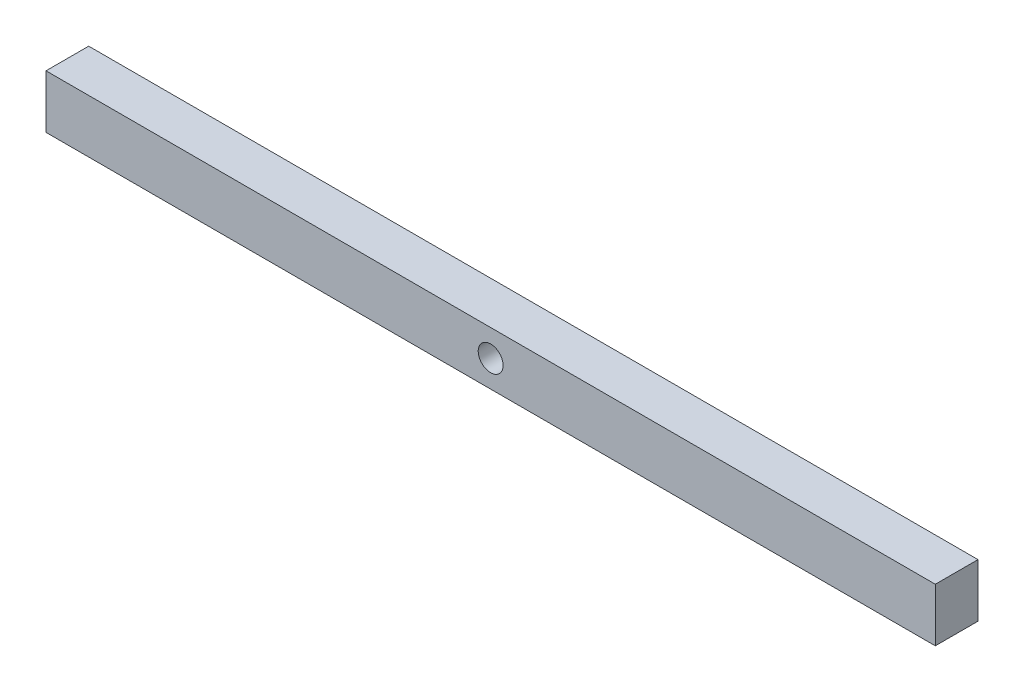
ISO-10303-21;
HEADER;
FILE_DESCRIPTION(('STEP AP214'),'2;1');
FILE_NAME('part.step','',(''),(''),'','','');
FILE_SCHEMA(('AUTOMOTIVE_DESIGN { 1 0 10303 214 1 1 1 1 }'));
ENDSEC;
DATA;
#1=APPLICATION_CONTEXT('core data for automotive mechanical design processes');
#2=APPLICATION_PROTOCOL_DEFINITION('international standard','automotive_design',2000,#1);
#3=PRODUCT_CONTEXT('',#1,'mechanical');
#4=PRODUCT('Part','Part','',(#3));
#5=PRODUCT_RELATED_PRODUCT_CATEGORY('part','',(#4));
#6=PRODUCT_DEFINITION_FORMATION('','',#4);
#7=PRODUCT_DEFINITION_CONTEXT('part definition',#1,'design');
#8=PRODUCT_DEFINITION('design','',#6,#7);
#9=PRODUCT_DEFINITION_SHAPE('','',#8);
#10=(LENGTH_UNIT() NAMED_UNIT(*) SI_UNIT(.MILLI.,.METRE.));
#11=(NAMED_UNIT(*) PLANE_ANGLE_UNIT() SI_UNIT($,.RADIAN.));
#12=(NAMED_UNIT(*) SI_UNIT($,.STERADIAN.) SOLID_ANGLE_UNIT());
#13=UNCERTAINTY_MEASURE_WITH_UNIT(LENGTH_MEASURE(1.E-05),#10,'distance_accuracy_value','');
#14=(GEOMETRIC_REPRESENTATION_CONTEXT(3) GLOBAL_UNCERTAINTY_ASSIGNED_CONTEXT((#13)) GLOBAL_UNIT_ASSIGNED_CONTEXT((#10,
#11,#12)) REPRESENTATION_CONTEXT('',''));
#15=CARTESIAN_POINT('',(0.,0.,0.));
#16=DIRECTION('',(0.,0.,1.));
#17=DIRECTION('',(1.,0.,0.));
#18=AXIS2_PLACEMENT_3D('',#15,#16,#17);
#19=CARTESIAN_POINT('',(0.,0.,6.096));
#20=DIRECTION('',(0.,0.,-1.));
#21=DIRECTION('',(-1.,0.,0.));
#22=AXIS2_PLACEMENT_3D('',#19,#20,#21);
#23=PLANE('',#22);
#24=DIRECTION('',(0.,-1.,0.));
#25=VECTOR('',#24,1.);
#26=CARTESIAN_POINT('',(0.,0.,6.096));
#27=LINE('',#26,#25);
#28=CARTESIAN_POINT('',(0.,7.62,6.096));
#29=VERTEX_POINT('',#28);
#30=CARTESIAN_POINT('',(0.,0.,6.096));
#31=VERTEX_POINT('',#30);
#32=EDGE_CURVE('E84',#29,#31,#27,.T.);
#33=ORIENTED_EDGE('',*,*,#32,.T.);
#34=DIRECTION('',(1.,0.,0.));
#35=VECTOR('',#34,1.);
#36=CARTESIAN_POINT('',(0.,0.,6.096));
#37=LINE('',#36,#35);
#38=CARTESIAN_POINT('',(127.,0.,6.096));
#39=VERTEX_POINT('',#38);
#40=EDGE_CURVE('E79',#31,#39,#37,.T.);
#41=ORIENTED_EDGE('',*,*,#40,.T.);
#42=DIRECTION('',(0.,1.,0.));
#43=VECTOR('',#42,1.);
#44=CARTESIAN_POINT('',(127.,0.,6.096));
#45=LINE('',#44,#43);
#46=CARTESIAN_POINT('',(127.,7.62,6.096));
#47=VERTEX_POINT('',#46);
#48=EDGE_CURVE('E82',#39,#47,#45,.T.);
#49=ORIENTED_EDGE('',*,*,#48,.T.);
#50=DIRECTION('',(-1.,0.,0.));
#51=VECTOR('',#50,1.);
#52=CARTESIAN_POINT('',(0.,7.62,6.096));
#53=LINE('',#52,#51);
#54=EDGE_CURVE('E49',#47,#29,#53,.T.);
#55=ORIENTED_EDGE('',*,*,#54,.T.);
#56=EDGE_LOOP('',(#33,#41,#49,#55));
#57=FACE_BOUND('',#56,.T.);
#58=CARTESIAN_POINT('',(63.5,3.81,6.096));
#59=DIRECTION('',(0.,0.,1.));
#60=DIRECTION('',(1.,0.,0.));
#61=AXIS2_PLACEMENT_3D('',#58,#59,#60);
#62=CIRCLE('',#61,1.77800000000001);
#63=CARTESIAN_POINT('',(65.278,3.81,6.096));
#64=VERTEX_POINT('',#63);
#65=EDGE_CURVE('E99',#64,#64,#62,.T.);
#66=ORIENTED_EDGE('',*,*,#65,.F.);
#67=EDGE_LOOP('',(#66));
#68=FACE_BOUND('',#67,.T.);
#69=ADVANCED_FACE('F32',(#57,#68),#23,.F.);
#70=CARTESIAN_POINT('',(0.,0.,0.));
#71=DIRECTION('',(0.,0.,-1.));
#72=DIRECTION('',(-1.,0.,0.));
#73=AXIS2_PLACEMENT_3D('',#70,#71,#72);
#74=PLANE('',#73);
#75=DIRECTION('',(0.,-1.,0.));
#76=VECTOR('',#75,1.);
#77=CARTESIAN_POINT('',(0.,0.,0.));
#78=LINE('',#77,#76);
#79=CARTESIAN_POINT('',(0.,7.62,0.));
#80=VERTEX_POINT('',#79);
#81=CARTESIAN_POINT('',(0.,0.,0.));
#82=VERTEX_POINT('',#81);
#83=EDGE_CURVE('E96',#80,#82,#78,.T.);
#84=ORIENTED_EDGE('',*,*,#83,.F.);
#85=DIRECTION('',(-1.,0.,0.));
#86=VECTOR('',#85,1.);
#87=CARTESIAN_POINT('',(0.,7.62,0.));
#88=LINE('',#87,#86);
#89=CARTESIAN_POINT('',(127.,7.62,0.));
#90=VERTEX_POINT('',#89);
#91=EDGE_CURVE('E72',#90,#80,#88,.T.);
#92=ORIENTED_EDGE('',*,*,#91,.F.);
#93=DIRECTION('',(0.,1.,0.));
#94=VECTOR('',#93,1.);
#95=CARTESIAN_POINT('',(127.,0.,0.));
#96=LINE('',#95,#94);
#97=CARTESIAN_POINT('',(127.,0.,0.));
#98=VERTEX_POINT('',#97);
#99=EDGE_CURVE('E66',#98,#90,#96,.T.);
#100=ORIENTED_EDGE('',*,*,#99,.F.);
#101=DIRECTION('',(1.,0.,0.));
#102=VECTOR('',#101,1.);
#103=CARTESIAN_POINT('',(0.,0.,0.));
#104=LINE('',#103,#102);
#105=EDGE_CURVE('E88',#82,#98,#104,.T.);
#106=ORIENTED_EDGE('',*,*,#105,.F.);
#107=EDGE_LOOP('',(#84,#92,#100,#106));
#108=FACE_BOUND('',#107,.T.);
#109=CARTESIAN_POINT('',(63.5,3.81,0.));
#110=DIRECTION('',(0.,0.,1.));
#111=DIRECTION('',(1.,0.,0.));
#112=AXIS2_PLACEMENT_3D('',#109,#110,#111);
#113=CIRCLE('',#112,1.77800000000001);
#114=CARTESIAN_POINT('',(65.278,3.81,0.));
#115=VERTEX_POINT('',#114);
#116=EDGE_CURVE('E111',#115,#115,#113,.T.);
#117=ORIENTED_EDGE('',*,*,#116,.T.);
#118=EDGE_LOOP('',(#117));
#119=FACE_BOUND('',#118,.T.);
#120=ADVANCED_FACE('F107',(#108,#119),#74,.T.);
#121=CARTESIAN_POINT('',(0.,0.,6.096));
#122=DIRECTION('',(1.,0.,0.));
#123=DIRECTION('',(0.,0.,-1.));
#124=AXIS2_PLACEMENT_3D('',#121,#122,#123);
#125=PLANE('',#124);
#126=ORIENTED_EDGE('',*,*,#83,.T.);
#127=DIRECTION('',(0.,0.,-1.));
#128=VECTOR('',#127,1.);
#129=CARTESIAN_POINT('',(0.,0.,6.096));
#130=LINE('',#129,#128);
#131=EDGE_CURVE('E11',#31,#82,#130,.T.);
#132=ORIENTED_EDGE('',*,*,#131,.F.);
#133=ORIENTED_EDGE('',*,*,#32,.F.);
#134=DIRECTION('',(0.,0.,-1.));
#135=VECTOR('',#134,1.);
#136=CARTESIAN_POINT('',(0.,7.62,6.096));
#137=LINE('',#136,#135);
#138=EDGE_CURVE('E92',#29,#80,#137,.T.);
#139=ORIENTED_EDGE('',*,*,#138,.T.);
#140=EDGE_LOOP('',(#126,#132,#133,#139));
#141=FACE_BOUND('',#140,.T.);
#142=ADVANCED_FACE('F34',(#141),#125,.F.);
#143=CARTESIAN_POINT('',(0.,0.,6.096));
#144=DIRECTION('',(0.,1.,0.));
#145=DIRECTION('',(-1.,0.,0.));
#146=AXIS2_PLACEMENT_3D('',#143,#144,#145);
#147=PLANE('',#146);
#148=ORIENTED_EDGE('',*,*,#105,.T.);
#149=DIRECTION('',(0.,0.,-1.));
#150=VECTOR('',#149,1.);
#151=CARTESIAN_POINT('',(127.,0.,6.096));
#152=LINE('',#151,#150);
#153=EDGE_CURVE('E41',#39,#98,#152,.T.);
#154=ORIENTED_EDGE('',*,*,#153,.F.);
#155=ORIENTED_EDGE('',*,*,#40,.F.);
#156=ORIENTED_EDGE('',*,*,#131,.T.);
#157=EDGE_LOOP('',(#148,#154,#155,#156));
#158=FACE_BOUND('',#157,.T.);
#159=ADVANCED_FACE('F87',(#158),#147,.F.);
#160=CARTESIAN_POINT('',(127.,0.,6.096));
#161=DIRECTION('',(-1.,0.,0.));
#162=DIRECTION('',(0.,0.,1.));
#163=AXIS2_PLACEMENT_3D('',#160,#161,#162);
#164=PLANE('',#163);
#165=ORIENTED_EDGE('',*,*,#99,.T.);
#166=DIRECTION('',(0.,0.,-1.));
#167=VECTOR('',#166,1.);
#168=CARTESIAN_POINT('',(127.,7.62,6.096));
#169=LINE('',#168,#167);
#170=EDGE_CURVE('E89',#47,#90,#169,.T.);
#171=ORIENTED_EDGE('',*,*,#170,.F.);
#172=ORIENTED_EDGE('',*,*,#48,.F.);
#173=ORIENTED_EDGE('',*,*,#153,.T.);
#174=EDGE_LOOP('',(#165,#171,#172,#173));
#175=FACE_BOUND('',#174,.T.);
#176=ADVANCED_FACE('F90',(#175),#164,.F.);
#177=CARTESIAN_POINT('',(0.,7.62,6.096));
#178=DIRECTION('',(0.,-1.,0.));
#179=DIRECTION('',(0.,0.,-1.));
#180=AXIS2_PLACEMENT_3D('',#177,#178,#179);
#181=PLANE('',#180);
#182=ORIENTED_EDGE('',*,*,#91,.T.);
#183=ORIENTED_EDGE('',*,*,#138,.F.);
#184=ORIENTED_EDGE('',*,*,#54,.F.);
#185=ORIENTED_EDGE('',*,*,#170,.T.);
#186=EDGE_LOOP('',(#182,#183,#184,#185));
#187=FACE_BOUND('',#186,.T.);
#188=ADVANCED_FACE('F104',(#187),#181,.F.);
#189=CARTESIAN_POINT('',(63.5,3.81,6.096));
#190=DIRECTION('',(0.,0.,-1.));
#191=DIRECTION('',(-1.,0.,0.));
#192=AXIS2_PLACEMENT_3D('',#189,#190,#191);
#193=CYLINDRICAL_SURFACE('',#192,1.77800000000001);
#194=ORIENTED_EDGE('',*,*,#65,.T.);
#195=EDGE_LOOP('',(#194));
#196=FACE_BOUND('',#195,.T.);
#197=ORIENTED_EDGE('',*,*,#116,.F.);
#198=EDGE_LOOP('',(#197));
#199=FACE_BOUND('',#198,.T.);
#200=ADVANCED_FACE('F117',(#196,#199),#193,.F.);
#201=CLOSED_SHELL('',(#69,#120,#142,#159,#176,#188,#200));
#202=MANIFOLD_SOLID_BREP('B2',#201);
#203=ADVANCED_BREP_SHAPE_REPRESENTATION('',(#18,#202),#14);
#204=SHAPE_DEFINITION_REPRESENTATION(#9,#203);
ENDSEC;
END-ISO-10303-21;
